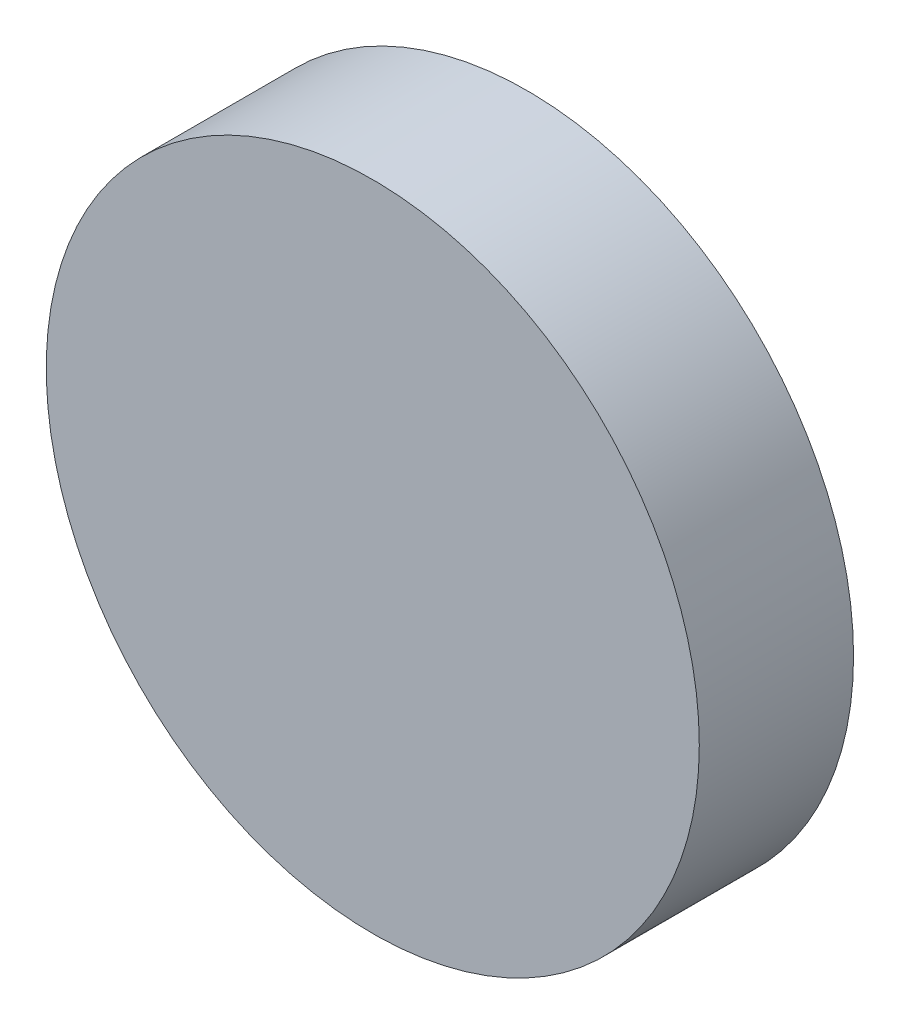
ISO-10303-21;
HEADER;
FILE_DESCRIPTION(('STEP AP214'),'2;1');
FILE_NAME('part.step','',(''),(''),'','','');
FILE_SCHEMA(('AUTOMOTIVE_DESIGN { 1 0 10303 214 1 1 1 1 }'));
ENDSEC;
DATA;
#1=APPLICATION_CONTEXT('core data for automotive mechanical design processes');
#2=APPLICATION_PROTOCOL_DEFINITION('international standard','automotive_design',2000,#1);
#3=PRODUCT_CONTEXT('',#1,'mechanical');
#4=PRODUCT('Part','Part','',(#3));
#5=PRODUCT_RELATED_PRODUCT_CATEGORY('part','',(#4));
#6=PRODUCT_DEFINITION_FORMATION('','',#4);
#7=PRODUCT_DEFINITION_CONTEXT('part definition',#1,'design');
#8=PRODUCT_DEFINITION('design','',#6,#7);
#9=PRODUCT_DEFINITION_SHAPE('','',#8);
#10=(LENGTH_UNIT() NAMED_UNIT(*) SI_UNIT(.MILLI.,.METRE.));
#11=(NAMED_UNIT(*) PLANE_ANGLE_UNIT() SI_UNIT($,.RADIAN.));
#12=(NAMED_UNIT(*) SI_UNIT($,.STERADIAN.) SOLID_ANGLE_UNIT());
#13=UNCERTAINTY_MEASURE_WITH_UNIT(LENGTH_MEASURE(1.E-05),#10,'distance_accuracy_value','');
#14=(GEOMETRIC_REPRESENTATION_CONTEXT(3) GLOBAL_UNCERTAINTY_ASSIGNED_CONTEXT((#13)) GLOBAL_UNIT_ASSIGNED_CONTEXT((#10,
#11,#12)) REPRESENTATION_CONTEXT('',''));
#15=CARTESIAN_POINT('',(0.,0.,0.));
#16=DIRECTION('',(0.,0.,1.));
#17=DIRECTION('',(1.,0.,0.));
#18=AXIS2_PLACEMENT_3D('',#15,#16,#17);
#19=CARTESIAN_POINT('',(0.,0.,3.));
#20=DIRECTION('',(0.,0.,-1.));
#21=DIRECTION('',(-1.,0.,0.));
#22=AXIS2_PLACEMENT_3D('',#19,#20,#21);
#23=CYLINDRICAL_SURFACE('',#22,6.35);
#24=CARTESIAN_POINT('',(0.,0.,3.));
#25=DIRECTION('',(0.,0.,1.));
#26=DIRECTION('',(1.,0.,0.));
#27=AXIS2_PLACEMENT_3D('',#24,#25,#26);
#28=CIRCLE('',#27,6.35);
#29=CARTESIAN_POINT('',(6.35,0.,3.));
#30=VERTEX_POINT('',#29);
#31=EDGE_CURVE('E10',#30,#30,#28,.T.);
#32=ORIENTED_EDGE('',*,*,#31,.F.);
#33=EDGE_LOOP('',(#32));
#34=FACE_BOUND('',#33,.T.);
#35=CARTESIAN_POINT('',(0.,0.,0.));
#36=DIRECTION('',(0.,0.,1.));
#37=DIRECTION('',(1.,0.,0.));
#38=AXIS2_PLACEMENT_3D('',#35,#36,#37);
#39=CIRCLE('',#38,6.35);
#40=CARTESIAN_POINT('',(6.35,0.,0.));
#41=VERTEX_POINT('',#40);
#42=EDGE_CURVE('E38',#41,#41,#39,.T.);
#43=ORIENTED_EDGE('',*,*,#42,.T.);
#44=EDGE_LOOP('',(#43));
#45=FACE_BOUND('',#44,.T.);
#46=ADVANCED_FACE('F35',(#34,#45),#23,.T.);
#47=CARTESIAN_POINT('',(0.,0.,3.));
#48=DIRECTION('',(0.,0.,1.));
#49=DIRECTION('',(1.,0.,0.));
#50=AXIS2_PLACEMENT_3D('',#47,#48,#49);
#51=PLANE('',#50);
#52=ORIENTED_EDGE('',*,*,#31,.T.);
#53=EDGE_LOOP('',(#52));
#54=FACE_BOUND('',#53,.T.);
#55=ADVANCED_FACE('F50',(#54),#51,.T.);
#56=CARTESIAN_POINT('',(0.,0.,0.));
#57=DIRECTION('',(0.,0.,1.));
#58=DIRECTION('',(1.,0.,0.));
#59=AXIS2_PLACEMENT_3D('',#56,#57,#58);
#60=PLANE('',#59);
#61=ORIENTED_EDGE('',*,*,#42,.F.);
#62=EDGE_LOOP('',(#61));
#63=FACE_BOUND('',#62,.T.);
#64=ADVANCED_FACE('F48',(#63),#60,.F.);
#65=CLOSED_SHELL('',(#46,#55,#64));
#66=MANIFOLD_SOLID_BREP('B2',#65);
#67=ADVANCED_BREP_SHAPE_REPRESENTATION('',(#18,#66),#14);
#68=SHAPE_DEFINITION_REPRESENTATION(#9,#67);
ENDSEC;
END-ISO-10303-21;
